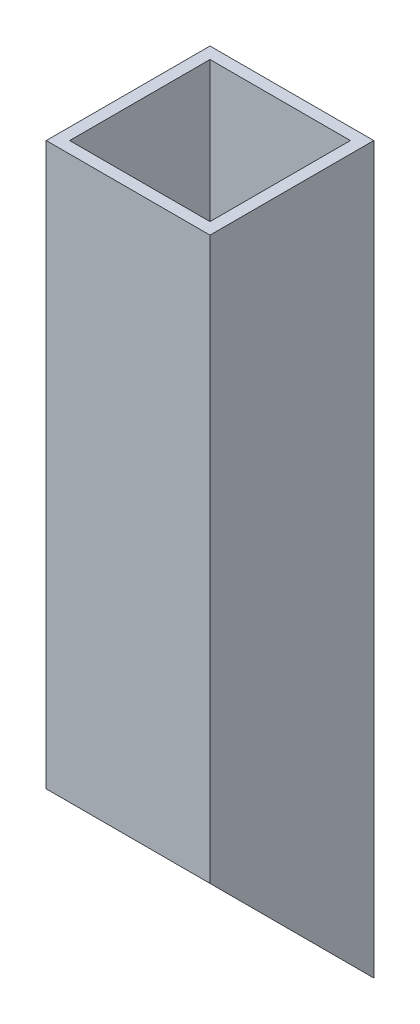
ISO-10303-21;
HEADER;
FILE_DESCRIPTION(('STEP AP214'),'2;1');
FILE_NAME('part.step','',(''),(''),'','','');
FILE_SCHEMA(('AUTOMOTIVE_DESIGN { 1 0 10303 214 1 1 1 1 }'));
ENDSEC;
DATA;
#1=APPLICATION_CONTEXT('core data for automotive mechanical design processes');
#2=APPLICATION_PROTOCOL_DEFINITION('international standard','automotive_design',2000,#1);
#3=PRODUCT_CONTEXT('',#1,'mechanical');
#4=PRODUCT('Part','Part','',(#3));
#5=PRODUCT_RELATED_PRODUCT_CATEGORY('part','',(#4));
#6=PRODUCT_DEFINITION_FORMATION('','',#4);
#7=PRODUCT_DEFINITION_CONTEXT('part definition',#1,'design');
#8=PRODUCT_DEFINITION('design','',#6,#7);
#9=PRODUCT_DEFINITION_SHAPE('','',#8);
#10=(LENGTH_UNIT() NAMED_UNIT(*) SI_UNIT(.MILLI.,.METRE.));
#11=(NAMED_UNIT(*) PLANE_ANGLE_UNIT() SI_UNIT($,.RADIAN.));
#12=(NAMED_UNIT(*) SI_UNIT($,.STERADIAN.) SOLID_ANGLE_UNIT());
#13=UNCERTAINTY_MEASURE_WITH_UNIT(LENGTH_MEASURE(1.E-05),#10,'distance_accuracy_value','');
#14=(GEOMETRIC_REPRESENTATION_CONTEXT(3) GLOBAL_UNCERTAINTY_ASSIGNED_CONTEXT((#13)) GLOBAL_UNIT_ASSIGNED_CONTEXT((#10,
#11,#12)) REPRESENTATION_CONTEXT('',''));
#15=CARTESIAN_POINT('',(0.,0.,0.));
#16=DIRECTION('',(0.,0.,1.));
#17=DIRECTION('',(1.,0.,0.));
#18=AXIS2_PLACEMENT_3D('',#15,#16,#17);
#19=CARTESIAN_POINT('',(0.,196.85,0.));
#20=DIRECTION('',(0.,-1.,0.));
#21=DIRECTION('',(0.,0.,-1.));
#22=AXIS2_PLACEMENT_3D('',#19,#20,#21);
#23=PLANE('',#22);
#24=DIRECTION('',(0.,0.,1.));
#25=VECTOR('',#24,1.);
#26=CARTESIAN_POINT('',(0.,196.85,0.));
#27=LINE('',#26,#25);
#28=CARTESIAN_POINT('',(0.,196.85,-44.45));
#29=VERTEX_POINT('',#28);
#30=CARTESIAN_POINT('',(0.,196.85,0.));
#31=VERTEX_POINT('',#30);
#32=EDGE_CURVE('E119',#29,#31,#27,.T.);
#33=ORIENTED_EDGE('',*,*,#32,.T.);
#34=DIRECTION('',(1.,0.,0.));
#35=VECTOR('',#34,1.);
#36=CARTESIAN_POINT('',(0.,196.85,0.));
#37=LINE('',#36,#35);
#38=CARTESIAN_POINT('',(44.45,196.85,0.));
#39=VERTEX_POINT('',#38);
#40=EDGE_CURVE('E125',#31,#39,#37,.T.);
#41=ORIENTED_EDGE('',*,*,#40,.T.);
#42=DIRECTION('',(0.,0.,-1.));
#43=VECTOR('',#42,1.);
#44=CARTESIAN_POINT('',(44.45,196.85,0.));
#45=LINE('',#44,#43);
#46=CARTESIAN_POINT('',(44.45,196.85,-44.45));
#47=VERTEX_POINT('',#46);
#48=EDGE_CURVE('E122',#39,#47,#45,.T.);
#49=ORIENTED_EDGE('',*,*,#48,.T.);
#50=DIRECTION('',(-1.,0.,0.));
#51=VECTOR('',#50,1.);
#52=CARTESIAN_POINT('',(0.,196.85,-44.45));
#53=LINE('',#52,#51);
#54=EDGE_CURVE('E116',#47,#29,#53,.T.);
#55=ORIENTED_EDGE('',*,*,#54,.T.);
#56=EDGE_LOOP('',(#33,#41,#49,#55));
#57=FACE_BOUND('',#56,.T.);
#58=DIRECTION('',(1.,0.,0.));
#59=VECTOR('',#58,1.);
#60=CARTESIAN_POINT('',(3.175,196.85,-3.175));
#61=LINE('',#60,#59);
#62=CARTESIAN_POINT('',(3.175,196.85,-3.175));
#63=VERTEX_POINT('',#62);
#64=CARTESIAN_POINT('',(41.275,196.85,-3.175));
#65=VERTEX_POINT('',#64);
#66=EDGE_CURVE('E87',#63,#65,#61,.T.);
#67=ORIENTED_EDGE('',*,*,#66,.F.);
#68=DIRECTION('',(0.,0.,1.));
#69=VECTOR('',#68,1.);
#70=CARTESIAN_POINT('',(3.175,196.85,-3.175));
#71=LINE('',#70,#69);
#72=CARTESIAN_POINT('',(3.175,196.85,-41.275));
#73=VERTEX_POINT('',#72);
#74=EDGE_CURVE('E135',#73,#63,#71,.T.);
#75=ORIENTED_EDGE('',*,*,#74,.F.);
#76=DIRECTION('',(-1.,0.,0.));
#77=VECTOR('',#76,1.);
#78=CARTESIAN_POINT('',(3.175,196.85,-41.275));
#79=LINE('',#78,#77);
#80=CARTESIAN_POINT('',(41.275,196.85,-41.275));
#81=VERTEX_POINT('',#80);
#82=EDGE_CURVE('E138',#81,#73,#79,.T.);
#83=ORIENTED_EDGE('',*,*,#82,.F.);
#84=DIRECTION('',(0.,0.,-1.));
#85=VECTOR('',#84,1.);
#86=CARTESIAN_POINT('',(41.275,196.85,-3.175));
#87=LINE('',#86,#85);
#88=EDGE_CURVE('E97',#65,#81,#87,.T.);
#89=ORIENTED_EDGE('',*,*,#88,.F.);
#90=EDGE_LOOP('',(#67,#75,#83,#89));
#91=FACE_BOUND('',#90,.T.);
#92=ADVANCED_FACE('F32',(#57,#91),#23,.F.);
#93=CARTESIAN_POINT('',(0.,196.85,0.));
#94=DIRECTION('',(1.,0.,0.));
#95=DIRECTION('',(0.,0.,-1.));
#96=AXIS2_PLACEMENT_3D('',#93,#94,#95);
#97=PLANE('',#96);
#98=DIRECTION('',(0.,-1.,0.));
#99=VECTOR('',#98,1.);
#100=CARTESIAN_POINT('',(0.,196.85,-44.45));
#101=LINE('',#100,#99);
#102=CARTESIAN_POINT('',(0.,0.,-44.45));
#103=VERTEX_POINT('',#102);
#104=EDGE_CURVE('E114',#29,#103,#101,.T.);
#105=ORIENTED_EDGE('',*,*,#104,.T.);
#106=DIRECTION('',(0.,0.707106781186546,0.707106781186549));
#107=VECTOR('',#106,1.);
#108=CARTESIAN_POINT('',(0.,44.45,0.));
#109=LINE('',#108,#107);
#110=CARTESIAN_POINT('',(0.,44.45,0.));
#111=VERTEX_POINT('',#110);
#112=EDGE_CURVE('E11',#103,#111,#109,.T.);
#113=ORIENTED_EDGE('',*,*,#112,.T.);
#114=DIRECTION('',(0.,-1.,0.));
#115=VECTOR('',#114,1.);
#116=CARTESIAN_POINT('',(0.,196.85,0.));
#117=LINE('',#116,#115);
#118=EDGE_CURVE('E106',#31,#111,#117,.T.);
#119=ORIENTED_EDGE('',*,*,#118,.F.);
#120=ORIENTED_EDGE('',*,*,#32,.F.);
#121=EDGE_LOOP('',(#105,#113,#119,#120));
#122=FACE_BOUND('',#121,.T.);
#123=ADVANCED_FACE('F172',(#122),#97,.F.);
#124=CARTESIAN_POINT('',(0.,196.85,0.));
#125=DIRECTION('',(0.,0.,-1.));
#126=DIRECTION('',(-1.,0.,0.));
#127=AXIS2_PLACEMENT_3D('',#124,#125,#126);
#128=PLANE('',#127);
#129=ORIENTED_EDGE('',*,*,#118,.T.);
#130=DIRECTION('',(1.,0.,0.));
#131=VECTOR('',#130,1.);
#132=CARTESIAN_POINT('',(44.45,44.45,0.));
#133=LINE('',#132,#131);
#134=CARTESIAN_POINT('',(44.45,44.45,0.));
#135=VERTEX_POINT('',#134);
#136=EDGE_CURVE('E103',#111,#135,#133,.T.);
#137=ORIENTED_EDGE('',*,*,#136,.T.);
#138=DIRECTION('',(0.,-1.,0.));
#139=VECTOR('',#138,1.);
#140=CARTESIAN_POINT('',(44.45,196.85,0.));
#141=LINE('',#140,#139);
#142=EDGE_CURVE('E108',#39,#135,#141,.T.);
#143=ORIENTED_EDGE('',*,*,#142,.F.);
#144=ORIENTED_EDGE('',*,*,#40,.F.);
#145=EDGE_LOOP('',(#129,#137,#143,#144));
#146=FACE_BOUND('',#145,.T.);
#147=ADVANCED_FACE('F176',(#146),#128,.F.);
#148=CARTESIAN_POINT('',(44.45,196.85,0.));
#149=DIRECTION('',(-1.,0.,0.));
#150=DIRECTION('',(0.,0.,1.));
#151=AXIS2_PLACEMENT_3D('',#148,#149,#150);
#152=PLANE('',#151);
#153=ORIENTED_EDGE('',*,*,#142,.T.);
#154=DIRECTION('',(0.,-0.707106781186546,-0.707106781186549));
#155=VECTOR('',#154,1.);
#156=CARTESIAN_POINT('',(44.45,44.45,0.));
#157=LINE('',#156,#155);
#158=CARTESIAN_POINT('',(44.45,0.,-44.45));
#159=VERTEX_POINT('',#158);
#160=EDGE_CURVE('E42',#135,#159,#157,.T.);
#161=ORIENTED_EDGE('',*,*,#160,.T.);
#162=DIRECTION('',(0.,-1.,0.));
#163=VECTOR('',#162,1.);
#164=CARTESIAN_POINT('',(44.45,196.85,-44.45));
#165=LINE('',#164,#163);
#166=EDGE_CURVE('E111',#47,#159,#165,.T.);
#167=ORIENTED_EDGE('',*,*,#166,.F.);
#168=ORIENTED_EDGE('',*,*,#48,.F.);
#169=EDGE_LOOP('',(#153,#161,#167,#168));
#170=FACE_BOUND('',#169,.T.);
#171=ADVANCED_FACE('F179',(#170),#152,.F.);
#172=CARTESIAN_POINT('',(0.,196.85,-44.45));
#173=DIRECTION('',(0.,0.,1.));
#174=DIRECTION('',(1.,0.,0.));
#175=AXIS2_PLACEMENT_3D('',#172,#173,#174);
#176=PLANE('',#175);
#177=DIRECTION('',(-1.,0.,0.));
#178=VECTOR('',#177,1.);
#179=CARTESIAN_POINT('',(0.,0.,-44.45));
#180=LINE('',#179,#178);
#181=EDGE_CURVE('E88',#159,#103,#180,.T.);
#182=ORIENTED_EDGE('',*,*,#181,.T.);
#183=ORIENTED_EDGE('',*,*,#104,.F.);
#184=ORIENTED_EDGE('',*,*,#54,.F.);
#185=ORIENTED_EDGE('',*,*,#166,.T.);
#186=EDGE_LOOP('',(#182,#183,#184,#185));
#187=FACE_BOUND('',#186,.T.);
#188=ADVANCED_FACE('F167',(#187),#176,.F.);
#189=CARTESIAN_POINT('',(3.175,196.85,-3.175));
#190=DIRECTION('',(0.,0.,-1.));
#191=DIRECTION('',(-1.,0.,0.));
#192=AXIS2_PLACEMENT_3D('',#189,#190,#191);
#193=PLANE('',#192);
#194=DIRECTION('',(1.,0.,0.));
#195=VECTOR('',#194,1.);
#196=CARTESIAN_POINT('',(0.,41.275,-3.175));
#197=LINE('',#196,#195);
#198=CARTESIAN_POINT('',(3.175,41.275,-3.175));
#199=VERTEX_POINT('',#198);
#200=CARTESIAN_POINT('',(41.275,41.275,-3.175));
#201=VERTEX_POINT('',#200);
#202=EDGE_CURVE('E36',#199,#201,#197,.T.);
#203=ORIENTED_EDGE('',*,*,#202,.F.);
#204=DIRECTION('',(0.,-1.,0.));
#205=VECTOR('',#204,1.);
#206=CARTESIAN_POINT('',(3.175,196.85,-3.175));
#207=LINE('',#206,#205);
#208=EDGE_CURVE('E133',#63,#199,#207,.T.);
#209=ORIENTED_EDGE('',*,*,#208,.F.);
#210=ORIENTED_EDGE('',*,*,#66,.T.);
#211=DIRECTION('',(0.,-1.,0.));
#212=VECTOR('',#211,1.);
#213=CARTESIAN_POINT('',(41.275,196.85,-3.175));
#214=LINE('',#213,#212);
#215=EDGE_CURVE('E71',#65,#201,#214,.T.);
#216=ORIENTED_EDGE('',*,*,#215,.T.);
#217=EDGE_LOOP('',(#203,#209,#210,#216));
#218=FACE_BOUND('',#217,.T.);
#219=ADVANCED_FACE('F83',(#218),#193,.T.);
#220=CARTESIAN_POINT('',(41.275,196.85,-3.175));
#221=DIRECTION('',(-1.,0.,0.));
#222=DIRECTION('',(0.,0.,1.));
#223=AXIS2_PLACEMENT_3D('',#220,#221,#222);
#224=PLANE('',#223);
#225=DIRECTION('',(0.,-0.707106781186546,-0.707106781186549));
#226=VECTOR('',#225,1.);
#227=CARTESIAN_POINT('',(41.275,44.45,0.));
#228=LINE('',#227,#226);
#229=CARTESIAN_POINT('',(41.275,3.17500000000018,-41.275));
#230=VERTEX_POINT('',#229);
#231=EDGE_CURVE('E67',#201,#230,#228,.T.);
#232=ORIENTED_EDGE('',*,*,#231,.F.);
#233=ORIENTED_EDGE('',*,*,#215,.F.);
#234=ORIENTED_EDGE('',*,*,#88,.T.);
#235=DIRECTION('',(0.,-1.,0.));
#236=VECTOR('',#235,1.);
#237=CARTESIAN_POINT('',(41.275,196.85,-41.275));
#238=LINE('',#237,#236);
#239=EDGE_CURVE('E74',#81,#230,#238,.T.);
#240=ORIENTED_EDGE('',*,*,#239,.T.);
#241=EDGE_LOOP('',(#232,#233,#234,#240));
#242=FACE_BOUND('',#241,.T.);
#243=ADVANCED_FACE('F69',(#242),#224,.T.);
#244=CARTESIAN_POINT('',(3.175,196.85,-41.275));
#245=DIRECTION('',(0.,0.,1.));
#246=DIRECTION('',(1.,0.,0.));
#247=AXIS2_PLACEMENT_3D('',#244,#245,#246);
#248=PLANE('',#247);
#249=DIRECTION('',(-1.,0.,0.));
#250=VECTOR('',#249,1.);
#251=CARTESIAN_POINT('',(0.,3.17500000000015,-41.275));
#252=LINE('',#251,#250);
#253=CARTESIAN_POINT('',(3.175,3.17500000000018,-41.275));
#254=VERTEX_POINT('',#253);
#255=EDGE_CURVE('E79',#230,#254,#252,.T.);
#256=ORIENTED_EDGE('',*,*,#255,.F.);
#257=ORIENTED_EDGE('',*,*,#239,.F.);
#258=ORIENTED_EDGE('',*,*,#82,.T.);
#259=DIRECTION('',(0.,-1.,0.));
#260=VECTOR('',#259,1.);
#261=CARTESIAN_POINT('',(3.175,196.85,-41.275));
#262=LINE('',#261,#260);
#263=EDGE_CURVE('E131',#73,#254,#262,.T.);
#264=ORIENTED_EDGE('',*,*,#263,.T.);
#265=EDGE_LOOP('',(#256,#257,#258,#264));
#266=FACE_BOUND('',#265,.T.);
#267=ADVANCED_FACE('F147',(#266),#248,.T.);
#268=CARTESIAN_POINT('',(3.175,196.85,-3.175));
#269=DIRECTION('',(1.,0.,0.));
#270=DIRECTION('',(0.,0.,-1.));
#271=AXIS2_PLACEMENT_3D('',#268,#269,#270);
#272=PLANE('',#271);
#273=DIRECTION('',(0.,0.707106781186546,0.707106781186549));
#274=VECTOR('',#273,1.);
#275=CARTESIAN_POINT('',(3.175,44.45,0.));
#276=LINE('',#275,#274);
#277=EDGE_CURVE('E92',#254,#199,#276,.T.);
#278=ORIENTED_EDGE('',*,*,#277,.F.);
#279=ORIENTED_EDGE('',*,*,#263,.F.);
#280=ORIENTED_EDGE('',*,*,#74,.T.);
#281=ORIENTED_EDGE('',*,*,#208,.T.);
#282=EDGE_LOOP('',(#278,#279,#280,#281));
#283=FACE_BOUND('',#282,.T.);
#284=ADVANCED_FACE('F149',(#283),#272,.T.);
#285=CARTESIAN_POINT('',(0.,44.45,0.));
#286=DIRECTION('',(0.,-0.707106781186549,0.707106781186546));
#287=DIRECTION('',(-1.,0.,0.));
#288=AXIS2_PLACEMENT_3D('',#285,#286,#287);
#289=PLANE('',#288);
#290=ORIENTED_EDGE('',*,*,#112,.F.);
#291=ORIENTED_EDGE('',*,*,#181,.F.);
#292=ORIENTED_EDGE('',*,*,#160,.F.);
#293=ORIENTED_EDGE('',*,*,#136,.F.);
#294=EDGE_LOOP('',(#290,#291,#292,#293));
#295=FACE_BOUND('',#294,.T.);
#296=ORIENTED_EDGE('',*,*,#277,.T.);
#297=ORIENTED_EDGE('',*,*,#202,.T.);
#298=ORIENTED_EDGE('',*,*,#231,.T.);
#299=ORIENTED_EDGE('',*,*,#255,.T.);
#300=EDGE_LOOP('',(#296,#297,#298,#299));
#301=FACE_BOUND('',#300,.T.);
#302=ADVANCED_FACE('F34',(#295,#301),#289,.T.);
#303=CLOSED_SHELL('',(#92,#123,#147,#171,#188,#219,#243,#267,#284,#302));
#304=MANIFOLD_SOLID_BREP('B2',#303);
#305=ADVANCED_BREP_SHAPE_REPRESENTATION('',(#18,#304),#14);
#306=SHAPE_DEFINITION_REPRESENTATION(#9,#305);
ENDSEC;
END-ISO-10303-21;
